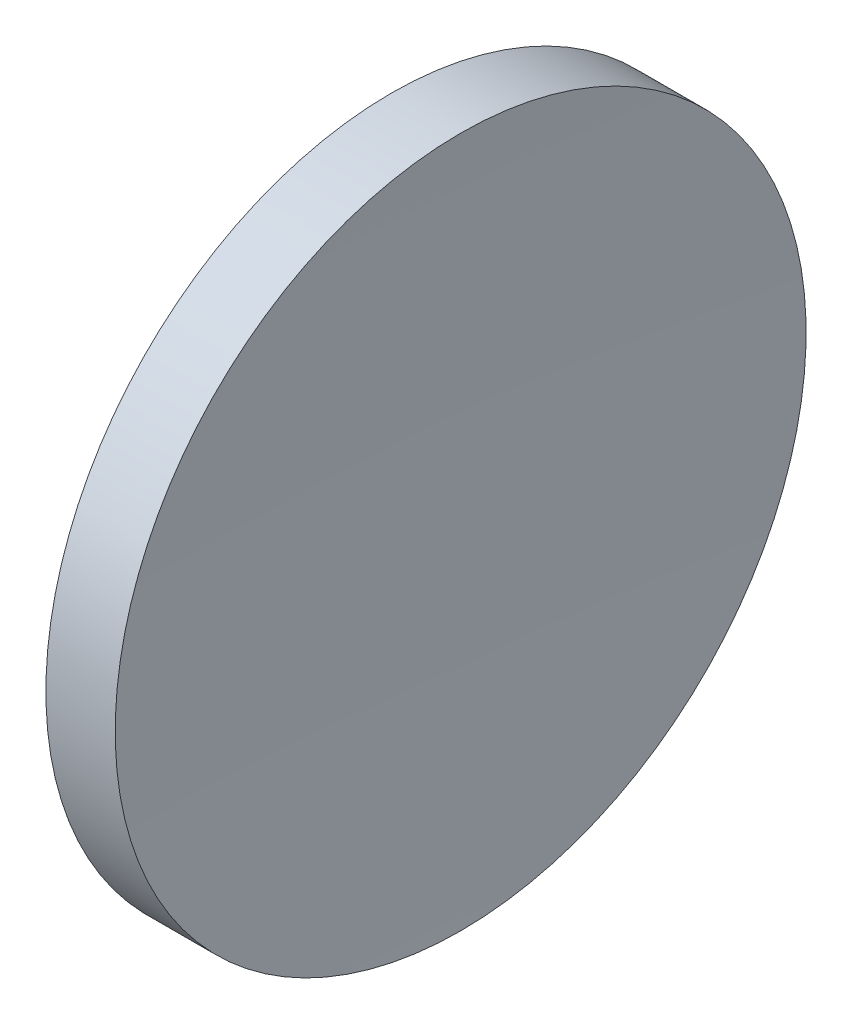
ISO-10303-21;
HEADER;
FILE_DESCRIPTION(('STEP AP214'),'2;1');
FILE_NAME('part.step','',(''),(''),'','','');
FILE_SCHEMA(('AUTOMOTIVE_DESIGN { 1 0 10303 214 1 1 1 1 }'));
ENDSEC;
DATA;
#1=APPLICATION_CONTEXT('core data for automotive mechanical design processes');
#2=APPLICATION_PROTOCOL_DEFINITION('international standard','automotive_design',2000,#1);
#3=PRODUCT_CONTEXT('',#1,'mechanical');
#4=PRODUCT('Part','Part','',(#3));
#5=PRODUCT_RELATED_PRODUCT_CATEGORY('part','',(#4));
#6=PRODUCT_DEFINITION_FORMATION('','',#4);
#7=PRODUCT_DEFINITION_CONTEXT('part definition',#1,'design');
#8=PRODUCT_DEFINITION('design','',#6,#7);
#9=PRODUCT_DEFINITION_SHAPE('','',#8);
#10=(LENGTH_UNIT() NAMED_UNIT(*) SI_UNIT(.MILLI.,.METRE.));
#11=(NAMED_UNIT(*) PLANE_ANGLE_UNIT() SI_UNIT($,.RADIAN.));
#12=(NAMED_UNIT(*) SI_UNIT($,.STERADIAN.) SOLID_ANGLE_UNIT());
#13=UNCERTAINTY_MEASURE_WITH_UNIT(LENGTH_MEASURE(1.E-05),#10,'distance_accuracy_value','');
#14=(GEOMETRIC_REPRESENTATION_CONTEXT(3) GLOBAL_UNCERTAINTY_ASSIGNED_CONTEXT((#13)) GLOBAL_UNIT_ASSIGNED_CONTEXT((#10,
#11,#12)) REPRESENTATION_CONTEXT('',''));
#15=CARTESIAN_POINT('',(0.,0.,0.));
#16=DIRECTION('',(0.,0.,1.));
#17=DIRECTION('',(1.,0.,0.));
#18=AXIS2_PLACEMENT_3D('',#15,#16,#17);
#19=CARTESIAN_POINT('',(378.190304152267,51.8974385390521,0.));
#20=DIRECTION('',(0.,0.,-1.));
#21=DIRECTION('',(0.,-1.,0.));
#22=AXIS2_PLACEMENT_3D('',#19,#20,#21);
#23=CIRCLE('',#22,281.09999989843);
#24=TRIMMED_CURVE('',#23,(PARAMETER_VALUE(-1.57179470390646)),
(PARAMETER_VALUE(1.57179470390646)),.T.,.PARAMETER.);
#25=CARTESIAN_POINT('',(378.190304152267,52.1780822983901,0.));
#26=DIRECTION('',(-1.,0.,0.));
#27=AXIS1_PLACEMENT('',#25,#26);
#28=SURFACE_OF_REVOLUTION('',#24,#27);
#29=CARTESIAN_POINT('',(97.3647897603854,52.1780822983899,0.));
#30=DIRECTION('',(-1.,0.,0.));
#31=DIRECTION('',(0.,-1.,0.));
#32=AXIS2_PLACEMENT_3D('',#29,#30,#31);
#33=CIRCLE('',#32,12.7);
#34=CARTESIAN_POINT('',(97.3647897603854,39.4780822983899,0.));
#35=VERTEX_POINT('',#34);
#36=EDGE_CURVE('E11',#35,#35,#33,.T.);
#37=ORIENTED_EDGE('',*,*,#36,.F.);
#38=EDGE_LOOP('',(#37));
#39=FACE_BOUND('',#38,.T.);
#40=CARTESIAN_POINT('',(97.0904443480015,52.1780822983899,0.));
#41=VERTEX_POINT('',#40);
#42=VERTEX_LOOP('',#41);
#43=FACE_BOUND('',#42,.T.);
#44=ADVANCED_FACE('F37',(#39,#43),#28,.F.);
#45=CARTESIAN_POINT('',(89.8586564536171,52.1780822983899,0.));
#46=DIRECTION('',(-1.,0.,0.));
#47=DIRECTION('',(0.,-1.,0.));
#48=AXIS2_PLACEMENT_3D('',#45,#46,#47);
#49=CYLINDRICAL_SURFACE('',#48,12.7);
#50=CARTESIAN_POINT('',(94.8160981763345,52.1780822983899,0.));
#51=DIRECTION('',(-1.,0.,0.));
#52=DIRECTION('',(0.,-1.,0.));
#53=AXIS2_PLACEMENT_3D('',#50,#51,#52);
#54=CIRCLE('',#53,12.6999999999999);
#55=CARTESIAN_POINT('',(94.8160981763345,39.47808229839,0.));
#56=VERTEX_POINT('',#55);
#57=EDGE_CURVE('E44',#56,#56,#54,.T.);
#58=ORIENTED_EDGE('',*,*,#57,.F.);
#59=EDGE_LOOP('',(#58));
#60=FACE_BOUND('',#59,.T.);
#61=ORIENTED_EDGE('',*,*,#36,.T.);
#62=EDGE_LOOP('',(#61));
#63=FACE_BOUND('',#62,.T.);
#64=ADVANCED_FACE('F53',(#60,#63),#49,.T.);
#65=CARTESIAN_POINT('',(-186.009416215547,51.897438539052,0.));
#66=DIRECTION('',(0.,0.,-1.));
#67=DIRECTION('',(0.,-1.,0.));
#68=AXIS2_PLACEMENT_3D('',#65,#66,#67);
#69=CIRCLE('',#68,281.09999989843);
#70=TRIMMED_CURVE('',#69,(PARAMETER_VALUE(-1.57179470390646)),
(PARAMETER_VALUE(1.57179470390646)),.T.,.PARAMETER.);
#71=CARTESIAN_POINT('',(-186.009416215547,52.1780822983898,0.));
#72=DIRECTION('',(-1.,0.,0.));
#73=AXIS1_PLACEMENT('',#71,#72);
#74=SURFACE_OF_REVOLUTION('',#70,#73);
#75=CARTESIAN_POINT('',(95.0904435887184,52.1780822983899,0.));
#76=VERTEX_POINT('',#75);
#77=VERTEX_LOOP('',#76);
#78=FACE_BOUND('',#77,.T.);
#79=ORIENTED_EDGE('',*,*,#57,.T.);
#80=EDGE_LOOP('',(#79));
#81=FACE_BOUND('',#80,.T.);
#82=ADVANCED_FACE('F50',(#78,#81),#74,.F.);
#83=CLOSED_SHELL('',(#44,#64,#82));
#84=MANIFOLD_SOLID_BREP('B2',#83);
#85=ADVANCED_BREP_SHAPE_REPRESENTATION('',(#18,#84),#14);
#86=SHAPE_DEFINITION_REPRESENTATION(#9,#85);
ENDSEC;
END-ISO-10303-21;
